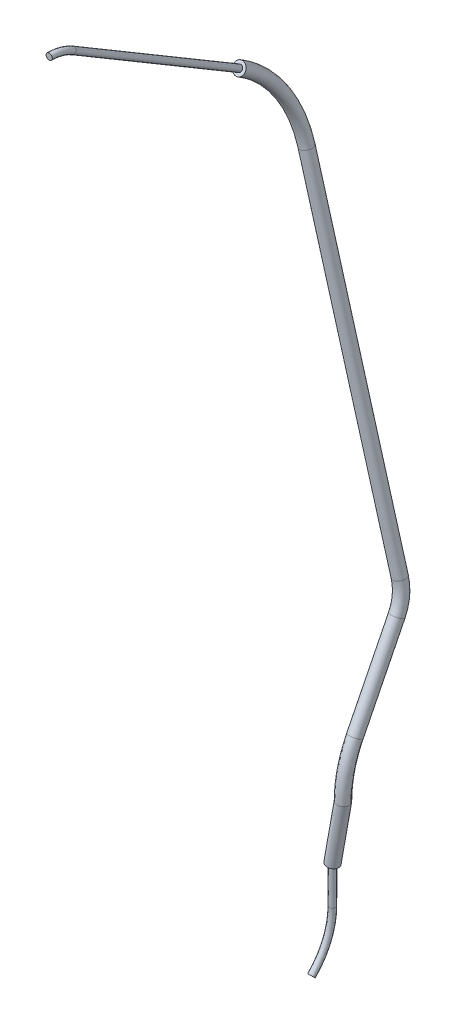
ISO-10303-21;
HEADER;
FILE_DESCRIPTION(('STEP AP214'),'2;1');
FILE_NAME('part.step','',(''),(''),'','','');
FILE_SCHEMA(('AUTOMOTIVE_DESIGN { 1 0 10303 214 1 1 1 1 }'));
ENDSEC;
DATA;
#1=APPLICATION_CONTEXT('core data for automotive mechanical design processes');
#2=APPLICATION_PROTOCOL_DEFINITION('international standard','automotive_design',2000,#1);
#3=PRODUCT_CONTEXT('',#1,'mechanical');
#4=PRODUCT('Part','Part','',(#3));
#5=PRODUCT_RELATED_PRODUCT_CATEGORY('part','',(#4));
#6=PRODUCT_DEFINITION_FORMATION('','',#4);
#7=PRODUCT_DEFINITION_CONTEXT('part definition',#1,'design');
#8=PRODUCT_DEFINITION('design','',#6,#7);
#9=PRODUCT_DEFINITION_SHAPE('','',#8);
#10=(LENGTH_UNIT() NAMED_UNIT(*) SI_UNIT(.MILLI.,.METRE.));
#11=(NAMED_UNIT(*) PLANE_ANGLE_UNIT() SI_UNIT($,.RADIAN.));
#12=(NAMED_UNIT(*) SI_UNIT($,.STERADIAN.) SOLID_ANGLE_UNIT());
#13=UNCERTAINTY_MEASURE_WITH_UNIT(LENGTH_MEASURE(1.E-05),#10,'distance_accuracy_value','');
#14=(GEOMETRIC_REPRESENTATION_CONTEXT(3) GLOBAL_UNCERTAINTY_ASSIGNED_CONTEXT((#13)) GLOBAL_UNIT_ASSIGNED_CONTEXT((#10,
#11,#12)) REPRESENTATION_CONTEXT('',''));
#15=CARTESIAN_POINT('',(0.,0.,0.));
#16=DIRECTION('',(0.,0.,1.));
#17=DIRECTION('',(1.,0.,0.));
#18=AXIS2_PLACEMENT_3D('',#15,#16,#17);
#19=CARTESIAN_POINT('',(0.,-17.0234803331168,-30.765300405085));
#20=DIRECTION('',(0.,0.510042589765679,0.860149147895363));
#21=DIRECTION('',(0.,-0.860149147895363,0.510042589765679));
#22=AXIS2_PLACEMENT_3D('',#19,#20,#21);
#23=PLANE('',#22);
#24=CARTESIAN_POINT('',(0.,-17.0234803331169,-30.765300405085));
#25=DIRECTION('',(0.,0.510042589765679,0.860149147895363));
#26=DIRECTION('',(0.,-0.860149147895363,0.510042589765679));
#27=AXIS2_PLACEMENT_3D('',#24,#25,#26);
#28=CIRCLE('',#27,0.5);
#29=CARTESIAN_POINT('',(0.,-17.4535549070645,-30.5102791102022));
#30=VERTEX_POINT('',#29);
#31=EDGE_CURVE('E85',#30,#30,#28,.F.);
#32=ORIENTED_EDGE('',*,*,#31,.T.);
#33=EDGE_LOOP('',(#32));
#34=FACE_BOUND('',#33,.T.);
#35=CARTESIAN_POINT('',(0.,-17.0234803331168,-30.765300405085));
#36=DIRECTION('',(0.,0.510042589765679,0.860149147895363));
#37=DIRECTION('',(0.,-0.860149147895363,0.510042589765679));
#38=AXIS2_PLACEMENT_3D('',#35,#36,#37);
#39=CIRCLE('',#38,1.);
#40=CARTESIAN_POINT('',(0.,-17.8836294810122,-30.2552578153194));
#41=VERTEX_POINT('',#40);
#42=EDGE_CURVE('E185',#41,#41,#39,.T.);
#43=ORIENTED_EDGE('',*,*,#42,.T.);
#44=EDGE_LOOP('',(#43));
#45=FACE_BOUND('',#44,.T.);
#46=ADVANCED_FACE('F33',(#34,#45),#23,.T.);
#47=CARTESIAN_POINT('',(11.3750000000001,-124.64905017384,-34.4978009791702));
#48=DIRECTION('',(0.173648177666929,0.98480358649297,-0.00286468559155684));
#49=DIRECTION('',(-0.145674277803661,0.0285630746051352,0.988920196757799));
#50=AXIS2_PLACEMENT_3D('',#47,#48,#49);
#51=PLANE('',#50);
#52=CARTESIAN_POINT('',(11.375,-124.64905017384,-34.4978009791702));
#53=DIRECTION('',(0.173648177666929,0.98480358649297,-0.00286468559155684));
#54=DIRECTION('',(-0.984807627375507,0.173648890186561,0.));
#55=AXIS2_PLACEMENT_3D('',#52,#53,#54);
#56=CIRCLE('',#55,0.5);
#57=CARTESIAN_POINT('',(11.3750000000002,-124.647595734848,-33.9978030945674));
#58=VERTEX_POINT('',#57);
#59=CARTESIAN_POINT('',(11.3750000000002,-124.650504612832,-34.9977988637729));
#60=VERTEX_POINT('',#59);
#61=EDGE_CURVE('E47',#58,#60,#56,.F.);
#62=ORIENTED_EDGE('',*,*,#61,.F.);
#63=CARTESIAN_POINT('',(11.375,-124.64905017384,-34.4978009791702));
#64=DIRECTION('',(0.173648177666929,0.98480358649297,-0.00286468559155684));
#65=DIRECTION('',(-0.984807753012208,0.173647442997171,-0.000505121361044732));
#66=AXIS2_PLACEMENT_3D('',#63,#64,#65);
#67=ELLIPSE('',#66,0.507713305942873,0.5);
#68=EDGE_CURVE('E11',#60,#58,#67,.F.);
#69=ORIENTED_EDGE('',*,*,#68,.F.);
#70=EDGE_LOOP('',(#62,#69));
#71=FACE_BOUND('',#70,.T.);
#72=CARTESIAN_POINT('',(11.3750000000001,-124.64905017384,-34.4978009791702));
#73=DIRECTION('',(0.173648177666929,0.98480358649297,-0.00286468559155684));
#74=DIRECTION('',(-0.145674277803661,0.0285630746051352,0.988920196757799));
#75=AXIS2_PLACEMENT_3D('',#72,#73,#74);
#76=CIRCLE('',#75,1.);
#77=CARTESIAN_POINT('',(11.2293257221964,-124.620487099235,-33.5088807824124));
#78=VERTEX_POINT('',#77);
#79=EDGE_CURVE('E80',#78,#78,#76,.T.);
#80=ORIENTED_EDGE('',*,*,#79,.F.);
#81=EDGE_LOOP('',(#80));
#82=FACE_BOUND('',#81,.T.);
#83=ADVANCED_FACE('F130',(#71,#82),#51,.F.);
#84=CARTESIAN_POINT('',(12.8976518624823,-115.476512798986,-33.535479600478));
#85=CARTESIAN_POINT('',(12.8976518624823,-115.37498214047,-33.5357749420249));
#86=CARTESIAN_POINT('',(12.8976518624823,-115.276171129653,-33.5360609237852));
#87=CARTESIAN_POINT('',(12.8976518624823,-114.807790953746,-33.537429898796));
#88=CARTESIAN_POINT('',(12.8976518624823,-114.424757984721,-33.549307471736));
#89=CARTESIAN_POINT('',(12.8976518624823,-113.679036212126,-33.5945023204089));
#90=CARTESIAN_POINT('',(12.8976518624823,-113.306848611569,-33.627842588081));
#91=CARTESIAN_POINT('',(12.8976518624823,-112.194101175336,-33.7599244855131));
#92=CARTESIAN_POINT('',(12.8976518624823,-111.457356959447,-33.8907651080352));
#93=CARTESIAN_POINT('',(12.8976518624823,-110.003833049586,-34.2362701157988));
#94=CARTESIAN_POINT('',(12.8976518624823,-109.28707465675,-34.450929506154));
#95=CARTESIAN_POINT('',(12.8976518624823,-108.23408221172,-34.8336151213657));
#96=CARTESIAN_POINT('',(12.8976518624823,-107.886771382208,-34.9712845780664));
#97=CARTESIAN_POINT('',(12.8976518624823,-107.200640934191,-35.26639427387));
#98=CARTESIAN_POINT('',(12.8976518624823,-106.853328671839,-35.4280819249529));
#99=CARTESIAN_POINT('',(12.8976518624823,-106.52777446062,-35.5909186843684));
#100=CARTESIAN_POINT('',(14.8756500611594,-115.475652227574,-33.2396377754311));
#101=CARTESIAN_POINT('',(14.8756500611594,-115.374121569058,-33.239933116978));
#102=CARTESIAN_POINT('',(14.8756500611594,-115.276124100586,-33.2402167101983));
#103=CARTESIAN_POINT('',(14.8756500611594,-114.804088807291,-33.2415964165422));
#104=CARTESIAN_POINT('',(14.8756500611594,-114.412532565775,-33.2536625008502));
#105=CARTESIAN_POINT('',(14.8756500611594,-113.655467865224,-33.299544793461));
#106=CARTESIAN_POINT('',(14.8756500611594,-113.277619041818,-33.3333921889497));
#107=CARTESIAN_POINT('',(14.8756500611594,-112.147945971306,-33.4674831405649));
#108=CARTESIAN_POINT('',(14.8756500611594,-111.399995382111,-33.6003139366467));
#109=CARTESIAN_POINT('',(14.8756500611594,-109.924362399421,-33.9510743071397));
#110=CARTESIAN_POINT('',(14.8756500611594,-109.196701631046,-34.1689988106879));
#111=CARTESIAN_POINT('',(14.8756500611594,-108.127692465197,-34.5575053305905));
#112=CARTESIAN_POINT('',(14.8756500611594,-107.775098805196,-34.6972688319955));
#113=CARTESIAN_POINT('',(14.8756500611594,-107.078531853211,-34.9968673440563));
#114=CARTESIAN_POINT('',(14.8756500611594,-106.723525381749,-35.1622204929431));
#115=CARTESIAN_POINT('',(14.8756500611594,-106.395430629614,-35.3263279883398));
#116=CARTESIAN_POINT('',(15.1714931378575,-115.481405982987,-35.2176276056042));
#117=CARTESIAN_POINT('',(15.1714931378575,-115.379875324471,-35.2179229471512));
#118=CARTESIAN_POINT('',(15.1714931378575,-115.276438535558,-35.2182225100807));
#119=CARTESIAN_POINT('',(15.1714931378575,-114.828841250722,-35.2195304670411));
#120=CARTESIAN_POINT('',(15.1714931378575,-114.494271360971,-35.2303361698339));
#121=CARTESIAN_POINT('',(15.1714931378575,-113.813045146516,-35.2716222322851));
#122=CARTESIAN_POINT('',(15.1714931378575,-113.473047094282,-35.3020789859551));
#123=CARTESIAN_POINT('',(15.1714931378575,-112.456538321864,-35.42273745979));
#124=CARTESIAN_POINT('',(15.1714931378575,-111.783513218335,-35.5422620133885));
#125=CARTESIAN_POINT('',(15.1714931378575,-110.45570085302,-35.8578851816507));
#126=CARTESIAN_POINT('',(15.1714931378575,-109.800933050115,-36.0539792334336));
#127=CARTESIAN_POINT('',(15.1714931378575,-108.839011213394,-36.4035673540367));
#128=CARTESIAN_POINT('',(15.1714931378575,-108.521738404256,-36.5293301335076));
#129=CARTESIAN_POINT('',(15.1714931378575,-107.894949613991,-36.7989165507335));
#130=CARTESIAN_POINT('',(15.1714931378575,-107.591386400654,-36.9397622880128));
#131=CARTESIAN_POINT('',(15.1714931378575,-107.280277631131,-37.0953736796313));
#132=CARTESIAN_POINT('',(13.1934949391805,-115.482266554399,-35.5134694306511));
#133=CARTESIAN_POINT('',(13.1934949391805,-115.380735895883,-35.5137647721981));
#134=CARTESIAN_POINT('',(13.1934949391805,-115.276485564625,-35.5140667236677));
#135=CARTESIAN_POINT('',(13.1934949391805,-114.832543397177,-35.5153639492942));
#136=CARTESIAN_POINT('',(13.1934949391805,-114.506496779917,-35.5259811407203));
#137=CARTESIAN_POINT('',(13.1934949391805,-113.836613493418,-35.5665797592323));
#138=CARTESIAN_POINT('',(13.1934949391805,-113.502276664032,-35.5965293850864));
#139=CARTESIAN_POINT('',(13.1934949391805,-112.502693525897,-35.7151788047383));
#140=CARTESIAN_POINT('',(13.1934949391805,-111.840874795666,-35.8327131847771));
#141=CARTESIAN_POINT('',(13.1934949391805,-110.53517150319,-36.1430809903099));
#142=CARTESIAN_POINT('',(13.1934949391805,-109.891306075819,-36.3359099288984));
#143=CARTESIAN_POINT('',(13.1934949391805,-108.945400959917,-36.6796771448126));
#144=CARTESIAN_POINT('',(13.1934949391805,-108.633410981268,-36.8033458795796));
#145=CARTESIAN_POINT('',(13.1934949391805,-108.01705869497,-37.068443480546));
#146=CARTESIAN_POINT('',(13.1934949391805,-107.721189690744,-37.2056237200226));
#147=CARTESIAN_POINT('',(13.1934949391805,-107.412621462137,-37.3599643756599));
#148=CARTESIAN_POINT('',(11.2154967405034,-115.483127125812,-35.809311255698));
#149=CARTESIAN_POINT('',(11.2154967405034,-115.381596467296,-35.809606597245));
#150=CARTESIAN_POINT('',(11.2154967405034,-115.276532593693,-35.8099109372547));
#151=CARTESIAN_POINT('',(11.2154967405034,-114.836245543631,-35.8111974315474));
#152=CARTESIAN_POINT('',(11.2154967405034,-114.518722198863,-35.8216261116068));
#153=CARTESIAN_POINT('',(11.2154967405034,-113.86018184032,-35.8615372861795));
#154=CARTESIAN_POINT('',(11.2154967405034,-113.531506233781,-35.8909797842176));
#155=CARTESIAN_POINT('',(11.2154967405034,-112.548848729929,-36.0076201496865));
#156=CARTESIAN_POINT('',(11.2154967405034,-111.898236372998,-36.1231643561657));
#157=CARTESIAN_POINT('',(11.2154967405034,-110.61464215336,-36.428276798969));
#158=CARTESIAN_POINT('',(11.2154967405034,-109.981679101523,-36.6178406243632));
#159=CARTESIAN_POINT('',(11.2154967405034,-109.051790706441,-36.9557869355884));
#160=CARTESIAN_POINT('',(11.2154967405034,-108.745083558281,-37.0773616256517));
#161=CARTESIAN_POINT('',(11.2154967405034,-108.139167775949,-37.3379704103585));
#162=CARTESIAN_POINT('',(11.2154967405034,-107.850992980833,-37.4714851520323));
#163=CARTESIAN_POINT('',(11.2154967405034,-107.544965293143,-37.6245550716885));
#164=CARTESIAN_POINT('',(10.9196536638052,-115.477373370399,-33.8313214255249));
#165=CARTESIAN_POINT('',(10.9196536638052,-115.375842711883,-33.8316167670718));
#166=CARTESIAN_POINT('',(10.9196536638052,-115.27621815872,-33.831905137372));
#167=CARTESIAN_POINT('',(10.9196536638052,-114.811493100201,-33.8332633810497));
#168=CARTESIAN_POINT('',(10.9196536638052,-114.436983403667,-33.8449524426218));
#169=CARTESIAN_POINT('',(10.9196536638052,-113.702604559028,-33.8894598473567));
#170=CARTESIAN_POINT('',(10.9196536638052,-113.33607818132,-33.9222929872122));
#171=CARTESIAN_POINT('',(10.9196536638052,-112.240256379367,-34.0523658304613));
#172=CARTESIAN_POINT('',(10.9196536638052,-111.514718536783,-34.1812162794238));
#173=CARTESIAN_POINT('',(10.9196536638052,-110.083303699751,-34.5214659244579));
#174=CARTESIAN_POINT('',(10.9196536638052,-109.377447682454,-34.7328602016201));
#175=CARTESIAN_POINT('',(10.9196536638052,-108.340471958244,-35.109724912141));
#176=CARTESIAN_POINT('',(10.9196536638052,-107.998443959219,-35.2453003241372));
#177=CARTESIAN_POINT('',(10.9196536638052,-107.322750015171,-35.5359212036837));
#178=CARTESIAN_POINT('',(10.9196536638052,-106.983131961928,-35.6939433569626));
#179=CARTESIAN_POINT('',(10.9196536638052,-106.660118291626,-35.855509380397));
#180=CARTESIAN_POINT('',(12.8976518624823,-115.476512798986,-33.535479600478));
#181=CARTESIAN_POINT('',(12.8976518624823,-115.37498214047,-33.5357749420249));
#182=CARTESIAN_POINT('',(12.8976518624823,-115.276171129653,-33.5360609237852));
#183=CARTESIAN_POINT('',(12.8976518624823,-114.807790953746,-33.537429898796));
#184=CARTESIAN_POINT('',(12.8976518624823,-114.424757984721,-33.549307471736));
#185=CARTESIAN_POINT('',(12.8976518624823,-113.679036212126,-33.5945023204089));
#186=CARTESIAN_POINT('',(12.8976518624823,-113.306848611569,-33.627842588081));
#187=CARTESIAN_POINT('',(12.8976518624823,-112.194101175336,-33.7599244855131));
#188=CARTESIAN_POINT('',(12.8976518624823,-111.457356959447,-33.8907651080352));
#189=CARTESIAN_POINT('',(12.8976518624823,-110.003833049586,-34.2362701157988));
#190=CARTESIAN_POINT('',(12.8976518624823,-109.28707465675,-34.450929506154));
#191=CARTESIAN_POINT('',(12.8976518624823,-108.23408221172,-34.8336151213657));
#192=CARTESIAN_POINT('',(12.8976518624823,-107.886771382208,-34.9712845780664));
#193=CARTESIAN_POINT('',(12.8976518624823,-107.200640934191,-35.26639427387));
#194=CARTESIAN_POINT('',(12.8976518624823,-106.853328671839,-35.4280819249529));
#195=CARTESIAN_POINT('',(12.8976518624823,-106.52777446062,-35.5909186843684));
#196=(BOUNDED_SURFACE() B_SPLINE_SURFACE(3,3,((#84,#85,#86,#87,#88,#89,#90,#91,#92,#93,#94,#95,
#96,#97,#98,#99),(#100,#101,#102,#103,#104,#105,#106,#107,#108,#109,#110,#111,#112,#113,#114,
#115),(#116,#117,#118,#119,#120,#121,#122,#123,#124,#125,#126,#127,#128,#129,#130,#131),(#132,
#133,#134,#135,#136,#137,#138,#139,#140,#141,#142,#143,#144,#145,#146,#147),(#148,#149,#150,
#151,#152,#153,#154,#155,#156,#157,#158,#159,#160,#161,#162,#163),(#164,#165,#166,#167,#168,
#169,#170,#171,#172,#173,#174,#175,#176,#177,#178,#179),(#180,#181,#182,#183,#184,#185,#186,
#187,#188,#189,#190,#191,#192,#193,#194,#195)),.UNSPECIFIED.,.T.,.F.,
.F.) B_SPLINE_SURFACE_WITH_KNOTS((4,3,4),(4,2,2,2,2,2,2,4),(0.,0.5,1.),(-0.00290507929286196,0.,
0.01014698357128,0.02029396714256,0.0405879342851201,0.0608819014276801,0.0710288849989601,
0.0811758685702401),
.UNSPECIFIED.) GEOMETRIC_REPRESENTATION_ITEM() RATIONAL_B_SPLINE_SURFACE(((1.,1.,1.,1.,1.,1.,1.,
1.,1.,1.,1.,1.,1.,1.,1.,1.),(0.333333333333333,0.333333333333333,0.333333333333333,
0.333333333333333,0.333333333333333,0.333333333333333,0.333333333333333,0.333333333333333,
0.333333333333333,0.333333333333333,0.333333333333333,0.333333333333333,0.333333333333333,
0.333333333333333,0.333333333333333,0.333333333333333),(0.333333333333333,0.333333333333333,
0.333333333333333,0.333333333333333,0.333333333333333,0.333333333333333,0.333333333333333,
0.333333333333333,0.333333333333333,0.333333333333333,0.333333333333333,0.333333333333333,
0.333333333333333,0.333333333333333,0.333333333333333,0.333333333333333),(1.,1.,1.,1.,1.,1.,1.,
1.,1.,1.,1.,1.,1.,1.,1.,1.),(0.333333333333333,0.333333333333333,0.333333333333333,
0.333333333333333,0.333333333333333,0.333333333333333,0.333333333333333,0.333333333333333,
0.333333333333333,0.333333333333333,0.333333333333333,0.333333333333333,0.333333333333333,
0.333333333333333,0.333333333333333,0.333333333333333),(0.333333333333333,0.333333333333333,
0.333333333333333,0.333333333333333,0.333333333333333,0.333333333333333,0.333333333333333,
0.333333333333333,0.333333333333333,0.333333333333333,0.333333333333333,0.333333333333333,
0.333333333333333,0.333333333333333,0.333333333333333,0.333333333333333),(1.,1.,1.,1.,1.,1.,1.,
1.,1.,1.,1.,1.,1.,1.,1.,1.))) REPRESENTATION_ITEM('') SURFACE());
#197=CARTESIAN_POINT('',(13.0456480512263,-115.177719741952,-35.525356268205));
#198=CARTESIAN_POINT('',(13.0506880710525,-115.178160676879,-35.5253548638416));
#199=CARTESIAN_POINT('',(13.0557292600387,-115.178601600282,-35.5253150567005));
#200=CARTESIAN_POINT('',(13.1170184255026,-115.183960827906,-35.5243651433296));
#201=CARTESIAN_POINT('',(13.1733206837038,-115.188869881261,-35.5187221224035));
#202=CARTESIAN_POINT('',(13.2564245092729,-115.196095058757,-35.5032308128934));
#203=CARTESIAN_POINT('',(13.2839433111579,-115.198484052794,-35.4968802756896));
#204=CARTESIAN_POINT('',(13.3383777073896,-115.20320253765,-35.4818706508086));
#205=CARTESIAN_POINT('',(13.3652928153871,-115.20553198069,-35.4732097695103));
#206=CARTESIAN_POINT('',(13.4447014694037,-115.212393629899,-35.4438792813993));
#207=CARTESIAN_POINT('',(13.4960014434298,-115.216811596923,-35.4198350125656));
#208=CARTESIAN_POINT('',(13.5938202232812,-115.225205073602,-35.363438917827));
#209=CARTESIAN_POINT('',(13.6403389000351,-115.229180571312,-35.3310868677356));
#210=CARTESIAN_POINT('',(13.7272091911063,-115.23657068124,-35.2590420301475));
#211=CARTESIAN_POINT('',(13.7675720993334,-115.239986321502,-35.2193629885686));
#212=CARTESIAN_POINT('',(13.8410642321791,-115.246166533288,-35.1337413918202));
#213=CARTESIAN_POINT('',(13.8741926772914,-115.248931034655,-35.0877981625563));
#214=CARTESIAN_POINT('',(13.9321411344282,-115.253719270187,-34.9911371185814));
#215=CARTESIAN_POINT('',(13.9569913758663,-115.25574570214,-34.9404375618482));
#216=CARTESIAN_POINT('',(13.9978276957464,-115.25901295384,-34.8355636706525));
#217=CARTESIAN_POINT('',(14.0138141256713,-115.260253804737,-34.7813894740673));
#218=CARTESIAN_POINT('',(14.0364194156899,-115.261910878692,-34.6712965098488));
#219=CARTESIAN_POINT('',(14.0430692051152,-115.262329826295,-34.6153841325043));
#220=CARTESIAN_POINT('',(14.0469073066588,-115.262339002835,-34.5032357568276));
#221=CARTESIAN_POINT('',(14.0440957234319,-115.261929240937,-34.4469997620819));
#222=CARTESIAN_POINT('',(14.0291050219369,-115.26029412185,-34.3358927268408));
#223=CARTESIAN_POINT('',(14.0169405311228,-115.259070038618,-34.2810196929521));
#224=CARTESIAN_POINT('',(13.9836139525308,-115.255842890581,-34.1741013992005));
#225=CARTESIAN_POINT('',(13.9624517431595,-115.253839815248,-34.1220561775629));
#226=CARTESIAN_POINT('',(13.9117172184365,-115.249110214896,-34.02221600106));
#227=CARTESIAN_POINT('',(13.8821370662205,-115.246383015898,-33.9744250614947));
#228=CARTESIAN_POINT('',(13.8154253904287,-115.240284369506,-33.8844932819677));
#229=CARTESIAN_POINT('',(13.7782944238842,-115.236912969638,-33.8423520256035));
#230=CARTESIAN_POINT('',(13.6972694304392,-115.229597527702,-33.7646266056847));
#231=CARTESIAN_POINT('',(13.653330776989,-115.225649717707,-33.7290893833474));
#232=CARTESIAN_POINT('',(13.5601058711593,-115.217309223595,-33.6659170016134));
#233=CARTESIAN_POINT('',(13.5108196071131,-115.212916538508,-33.6382818594566));
#234=CARTESIAN_POINT('',(13.433968431072,-115.206090812053,-33.6033399641118));
#235=CARTESIAN_POINT('',(13.4078325823464,-115.203773310941,-33.5927693850352));
#236=CARTESIAN_POINT('',(13.3547936037068,-115.199077762171,-33.5738785238962));
#237=CARTESIAN_POINT('',(13.3278911455966,-115.19669976771,-33.5655563347068));
#238=CARTESIAN_POINT('',(13.2463664398601,-115.189504240184,-33.5440755439396));
#239=CARTESIAN_POINT('',(13.1907883014494,-115.184612858106,-33.5343398874265));
#240=CARTESIAN_POINT('',(13.1106594589738,-115.177581825129,-33.5271707435188));
#241=CARTESIAN_POINT('',(13.0863836369353,-115.175454439984,-33.525891845444));
#242=CARTESIAN_POINT('',(13.0565596758133,-115.172843094902,-33.5254070855864));
#243=CARTESIAN_POINT('',(13.0510249464713,-115.172358576461,-33.5253630259317));
#244=CARTESIAN_POINT('',(13.0454900658595,-115.171874129037,-33.5253648173606));
#245=B_SPLINE_CURVE_WITH_KNOTS('',3,(#197,#198,#199,#200,#201,#202,#203,#204,#205,#206,#207,
#208,#209,#210,#211,#212,#213,#214,#215,#216,#217,#218,#219,#220,#221,#222,#223,#224,#225,#226,
#227,#228,#229,#230,#231,#232,#233,#234,#235,#236,#237,#238,#239,#240,#241,#242,#243,#244),
.UNSPECIFIED.,.F.,.F.,(4,2,2,2,2,2,2,2,2,2,2,2,2,2,2,2,2,2,2,2,2,2,2,4),(0.,0.0151810411372486,
0.184550154762547,0.269503890748024,0.354523772954298,0.524130805151303,0.693742414694329,
0.86303899627923,1.03235381041112,1.2010433830582,1.36972626606195,1.53784902702759,
1.70596992834797,1.87382843094029,2.04168920201334,2.20970676079039,2.37771192923624,
2.54686905768473,2.71602655517962,2.80080101970897,2.8855033495406,3.05445559388846,
3.12761362032992,3.14428125035015),.UNSPECIFIED.);
#246=CARTESIAN_POINT('',(13.0456480512263,-115.177719741952,-35.525356268205));
#247=VERTEX_POINT('',#246);
#248=CARTESIAN_POINT('',(13.0454900658595,-115.171874129037,-33.5253648173606));
#249=VERTEX_POINT('',#248);
#250=EDGE_CURVE('E74',#247,#249,#245,.T.);
#251=CARTESIAN_POINT('',(13.0456480512263,-115.177719741952,-35.525356268205));
#252=CARTESIAN_POINT('',(13.0406075363986,-115.177284465176,-35.5253581762457));
#253=CARTESIAN_POINT('',(13.035565845213,-115.176848995251,-35.5253216902201));
#254=CARTESIAN_POINT('',(12.9742634547718,-115.171552915975,-35.5244121446348));
#255=CARTESIAN_POINT('',(12.9179475889508,-115.166675757407,-35.5188059788634));
#256=CARTESIAN_POINT('',(12.8348228755158,-115.159450601128,-35.5033685413933));
#257=CARTESIAN_POINT('',(12.8072970264856,-115.157053593827,-35.4970357557382));
#258=CARTESIAN_POINT('',(12.752848428098,-115.15230298225,-35.4820609784066));
#259=CARTESIAN_POINT('',(12.725926165389,-115.149949413248,-35.4734171912386));
#260=CARTESIAN_POINT('',(12.646495812297,-115.142990386802,-35.4441364695739));
#261=CARTESIAN_POINT('',(12.5951813711245,-115.13847420438,-35.4201235159846));
#262=CARTESIAN_POINT('',(12.4973353093476,-115.129816774016,-35.3637847602441));
#263=CARTESIAN_POINT('',(12.4508038109264,-115.125675535651,-35.3314587458046));
#264=CARTESIAN_POINT('',(12.3639163813357,-115.11788974922,-35.2594638386449));
#265=CARTESIAN_POINT('',(12.323548410589,-115.114244234392,-35.2198096045421));
#266=CARTESIAN_POINT('',(12.250048913797,-115.107545531174,-35.1342320730524));
#267=CARTESIAN_POINT('',(12.2169181595973,-115.104492405966,-35.0883081078497));
#268=CARTESIAN_POINT('',(12.1589734451786,-115.099079643021,-34.9916881857385));
#269=CARTESIAN_POINT('',(12.1341278270904,-115.096717369867,-34.9410113639274));
#270=CARTESIAN_POINT('',(12.0933006657735,-115.092742472137,-34.8361784843608));
#271=CARTESIAN_POINT('',(12.0773187685148,-115.09112981762,-34.7820225656619));
#272=CARTESIAN_POINT('',(12.0547214893154,-115.088709676682,-34.6719623149352));
#273=CARTESIAN_POINT('',(12.0480750075303,-115.087899519506,-34.6160644253758));
#274=CARTESIAN_POINT('',(12.0442403682262,-115.087103756397,-34.5039395902785));
#275=CARTESIAN_POINT('',(12.04705211418,-115.087118142049,-34.4477126481047));
#276=CARTESIAN_POINT('',(12.0620397228348,-115.087975826686,-34.3366086990855));
#277=CARTESIAN_POINT('',(12.0742024071583,-115.088817959583,-34.2817299045088));
#278=CARTESIAN_POINT('',(12.1075226345496,-115.091309998354,-34.1747935229144));
#279=CARTESIAN_POINT('',(12.1286803104293,-115.092959916155,-34.1227359775656));
#280=CARTESIAN_POINT('',(12.1794073067195,-115.097026170949,-34.0228550698146));
#281=CARTESIAN_POINT('',(12.2089859833434,-115.099443360771,-33.9750364950833));
#282=CARTESIAN_POINT('',(12.275694653405,-115.10497668525,-33.8850446898821));
#283=CARTESIAN_POINT('',(12.3128240891435,-115.108092768289,-33.8428710428588));
#284=CARTESIAN_POINT('',(12.3938419848601,-115.114958384712,-33.7650812774159));
#285=CARTESIAN_POINT('',(12.4377743662533,-115.118712050937,-33.7295113321337));
#286=CARTESIAN_POINT('',(12.5309865897232,-115.126732145851,-33.6662699787553));
#287=CARTESIAN_POINT('',(12.5802664359401,-115.130998574938,-33.6385985767743));
#288=CARTESIAN_POINT('',(12.65710869899,-115.137686280659,-33.603601049466));
#289=CARTESIAN_POINT('',(12.683241804936,-115.139966331813,-33.5930116673303));
#290=CARTESIAN_POINT('',(12.7362755409991,-115.144603865691,-33.5740831250766));
#291=CARTESIAN_POINT('',(12.7631754994813,-115.146961280914,-33.5657420589355));
#292=CARTESIAN_POINT('',(12.844693066445,-115.154119617395,-33.5442049849157));
#293=CARTESIAN_POINT('',(12.9002670216232,-115.159018703562,-33.5344321170469));
#294=CARTESIAN_POINT('',(12.9803688236629,-115.166102402278,-33.5272133717393));
#295=CARTESIAN_POINT('',(13.004621362917,-115.168250049635,-33.5259194934648));
#296=CARTESIAN_POINT('',(13.034421626634,-115.170892314081,-33.5254146431298));
#297=CARTESIAN_POINT('',(13.0399557644884,-115.171383144495,-33.5253668001387));
#298=CARTESIAN_POINT('',(13.0454900658595,-115.171874129037,-33.5253648173606));
#299=B_SPLINE_CURVE_WITH_KNOTS('',3,(#251,#252,#253,#254,#255,#256,#257,#258,#259,#260,#261,
#262,#263,#264,#265,#266,#267,#268,#269,#270,#271,#272,#273,#274,#275,#276,#277,#278,#279,#280,
#281,#282,#283,#284,#285,#286,#287,#288,#289,#290,#291,#292,#293,#294,#295,#296,#297,#298),
.UNSPECIFIED.,.F.,.F.,(4,2,2,2,2,2,2,2,2,2,2,2,2,2,2,2,2,2,2,2,2,2,2,4),(0.,0.0151810505493031,
0.184571447944398,0.269535818811115,0.354566394032281,0.524195812760492,0.693829563695908,
0.863127599030947,1.03244368111398,1.20110518062008,1.36975994305314,1.53785150838931,
1.7059413582509,1.87379475054983,2.04165062130923,2.20969372227483,2.3777244160761,
2.54688904079616,2.71605379648856,2.80083258962083,2.8855392833638,3.05449986770103,
3.12759624314076,3.14426386166263),.UNSPECIFIED.);
#300=EDGE_CURVE('E78',#247,#249,#299,.T.);
#301=CARTESIAN_POINT('',(13.0455734008314,-106.970197961378,-36.4754415300141));
#302=DIRECTION('',(0.,0.894361629082733,-0.447344695312776));
#303=DIRECTION('',(-0.147921538349074,0.44242350075821,0.884522845645772));
#304=AXIS2_PLACEMENT_3D('',#301,#302,#303);
#305=CIRCLE('',#304,1.);
#306=CARTESIAN_POINT('',(12.8976518624823,-106.52777446062,-35.5909186843684));
#307=VERTEX_POINT('',#306);
#308=EDGE_CURVE('E97',#307,#307,#305,.T.);
#309=ORIENTED_EDGE('',*,*,#250,.F.);
#310=ORIENTED_EDGE('',*,*,#300,.T.);
#311=EDGE_LOOP('',(#309,#310));
#312=FACE_BOUND('',#311,.T.);
#313=ORIENTED_EDGE('',*,*,#308,.F.);
#314=EDGE_LOOP('',(#313));
#315=FACE_BOUND('',#314,.T.);
#316=ADVANCED_FACE('F76',(#312,#315),#196,.T.);
#317=CARTESIAN_POINT('',(13.0455734008314,-106.970197961378,-36.4754415300141));
#318=DIRECTION('',(0.,0.894361629082732,-0.447344695312777));
#319=DIRECTION('',(0.,0.447344695312777,0.894361629082732));
#320=AXIS2_PLACEMENT_3D('',#317,#318,#319);
#321=CYLINDRICAL_SURFACE('',#320,1.);
#322=CARTESIAN_POINT('',(13.0455734008314,-93.4356759823917,-43.245182554239));
#323=DIRECTION('',(0.,0.894361629082732,-0.447344695312777));
#324=DIRECTION('',(-0.147921538349074,0.44242350075821,0.884522845645772));
#325=AXIS2_PLACEMENT_3D('',#322,#323,#324);
#326=CIRCLE('',#325,1.);
#327=CARTESIAN_POINT('',(13.3895284690797,-93.8557264367801,-44.0849756994803));
#328=VERTEX_POINT('',#327);
#329=EDGE_CURVE('E198',#328,#328,#326,.T.);
#330=ORIENTED_EDGE('',*,*,#329,.F.);
#331=EDGE_LOOP('',(#330));
#332=FACE_BOUND('',#331,.T.);
#333=ORIENTED_EDGE('',*,*,#308,.T.);
#334=EDGE_LOOP('',(#333));
#335=FACE_BOUND('',#334,.T.);
#336=ADVANCED_FACE('F104',(#332,#335),#321,.T.);
#337=CARTESIAN_POINT('',(10.0825614332426,-89.8171378701828,-36.0107575686685));
#338=DIRECTION('',(0.938986108004958,0.153866475206827,0.307620215169823));
#339=DIRECTION('',(0.311327613512521,0.,-0.950302644984532));
#340=AXIS2_PLACEMENT_3D('',#337,#338,#339);
#341=TOROIDAL_SURFACE('',#340,8.61453207443263,1.);
#342=CARTESIAN_POINT('',(12.5817271709701,-88.7303440057256,-44.1828572115373));
#343=DIRECTION('',(-0.184772883281832,0.980004702162173,0.0738225259913959));
#344=DIRECTION('',(-0.095178857744553,-0.092606872686413,0.991143255119907));
#345=AXIS2_PLACEMENT_3D('',#342,#343,#344);
#346=CIRCLE('',#345,1.);
#347=CARTESIAN_POINT('',(12.8718376164515,-88.6041858052491,-45.1314983649115));
#348=VERTEX_POINT('',#347);
#349=EDGE_CURVE('E191',#348,#348,#346,.T.);
#350=CARTESIAN_POINT('',(10.0825614332426,-89.8171378701828,-36.0107575686685));
#351=DIRECTION('',(0.938986108004958,0.153866475206827,0.307620215169823));
#352=DIRECTION('',(0.311327613512521,0.,-0.950302644984532));
#353=AXIS2_PLACEMENT_3D('',#350,#351,#352);
#354=CIRCLE('',#353,9.61453207443263);
#355=EDGE_CURVE('',#328,#348,#354,.T.);
#356=ORIENTED_EDGE('',*,*,#329,.T.);
#357=ORIENTED_EDGE('',*,*,#349,.F.);
#358=ORIENTED_EDGE('',*,*,#355,.T.);
#359=ORIENTED_EDGE('',*,*,#355,.F.);
#360=EDGE_LOOP('',(#356,#358,#357,#359));
#361=FACE_BOUND('',#360,.T.);
#362=ADVANCED_FACE('F113',(#361),#341,.T.);
#363=CARTESIAN_POINT('',(12.5817271709701,-88.7303440057256,-44.1828572115373));
#364=DIRECTION('',(-0.184772883281833,0.980004702162172,0.073822525991397));
#365=DIRECTION('',(-0.982686064581317,-0.185278435004408,0.));
#366=AXIS2_PLACEMENT_3D('',#363,#364,#365);
#367=CYLINDRICAL_SURFACE('',#366,1.);
#368=CARTESIAN_POINT('',(1.80246156195574,-31.5589084841167,-39.8762046256388));
#369=DIRECTION('',(-0.184772883281832,0.980004702162172,0.0738225259913975));
#370=DIRECTION('',(-0.0951788577445526,-0.0926068726864147,0.991143255119906));
#371=AXIS2_PLACEMENT_3D('',#368,#369,#370);
#372=CIRCLE('',#371,1.);
#373=CARTESIAN_POINT('',(1.70728270421119,-31.6515153568031,-38.8850613705189));
#374=VERTEX_POINT('',#373);
#375=EDGE_CURVE('E186',#374,#374,#372,.T.);
#376=ORIENTED_EDGE('',*,*,#375,.F.);
#377=EDGE_LOOP('',(#376));
#378=FACE_BOUND('',#377,.T.);
#379=ORIENTED_EDGE('',*,*,#349,.T.);
#380=EDGE_LOOP('',(#379));
#381=FACE_BOUND('',#380,.T.);
#382=ADVANCED_FACE('F117',(#378,#381),#367,.T.);
#383=CARTESIAN_POINT('',(4.12786140350094,-32.4979946508969,-21.5893785579047));
#384=DIRECTION('',(0.974672852995715,0.192359870865765,-0.114063621342215));
#385=DIRECTION('',(-0.193623565288446,0.981075896638476,0.));
#386=AXIS2_PLACEMENT_3D('',#383,#384,#385);
#387=TOROIDAL_SURFACE('',#386,18.4579894593982,1.);
#388=ORIENTED_EDGE('',*,*,#42,.F.);
#389=EDGE_LOOP('',(#388));
#390=FACE_BOUND('',#389,.T.);
#391=ORIENTED_EDGE('',*,*,#375,.T.);
#392=EDGE_LOOP('',(#391));
#393=FACE_BOUND('',#392,.T.);
#394=ADVANCED_FACE('F121',(#390,#393),#387,.T.);
#395=CARTESIAN_POINT('',(11.3750000000001,-124.64905017384,-34.4978009791702));
#396=DIRECTION('',(0.173648177666928,0.98480358649297,-0.00286468559155732));
#397=DIRECTION('',(-0.984807627375507,0.17364889018656,0.));
#398=AXIS2_PLACEMENT_3D('',#395,#396,#397);
#399=CYLINDRICAL_SURFACE('',#398,1.);
#400=ORIENTED_EDGE('',*,*,#300,.F.);
#401=ORIENTED_EDGE('',*,*,#250,.T.);
#402=EDGE_LOOP('',(#400,#401));
#403=FACE_BOUND('',#402,.T.);
#404=ORIENTED_EDGE('',*,*,#79,.T.);
#405=EDGE_LOOP('',(#404));
#406=FACE_BOUND('',#405,.T.);
#407=ADVANCED_FACE('F82',(#403,#406),#399,.T.);
#408=CARTESIAN_POINT('',(11.375,-138.770920476734,-31.0884357408697));
#409=DIRECTION('',(0.,0.705046902214677,-0.709160676911437));
#410=DIRECTION('',(0.98899909933854,0.104900138265411,0.104291622383845));
#411=AXIS2_PLACEMENT_3D('',#408,#409,#410);
#412=PLANE('',#411);
#413=CARTESIAN_POINT('',(11.375,-138.770920476734,-31.0884357408697));
#414=DIRECTION('',(0.,0.705046902214677,-0.709160676911437));
#415=DIRECTION('',(0.98899909933854,0.104900138265411,0.104291622383845));
#416=AXIS2_PLACEMENT_3D('',#413,#414,#415);
#417=CIRCLE('',#416,0.5);
#418=CARTESIAN_POINT('',(11.8694995496693,-138.718470407601,-31.0362899296778));
#419=VERTEX_POINT('',#418);
#420=EDGE_CURVE('E41',#419,#419,#417,.T.);
#421=ORIENTED_EDGE('',*,*,#420,.F.);
#422=EDGE_LOOP('',(#421));
#423=FACE_BOUND('',#422,.T.);
#424=ADVANCED_FACE('F141',(#423),#412,.F.);
#425=CARTESIAN_POINT('',(11.375,-130.615572692253,-22.9803963654009));
#426=DIRECTION('',(1.,0.,0.));
#427=DIRECTION('',(0.,0.,-1.));
#428=AXIS2_PLACEMENT_3D('',#425,#426,#427);
#429=TOROIDAL_SURFACE('',#428,11.5,0.5);
#430=CARTESIAN_POINT('',(11.375,-130.649024789073,-34.480347711264));
#431=DIRECTION('',(0.,0.999995769205486,-0.00290887798435158));
#432=DIRECTION('',(0.98899909933854,0.000430285706314986,0.147920912523442));
#433=AXIS2_PLACEMENT_3D('',#430,#431,#432);
#434=CIRCLE('',#433,0.5);
#435=CARTESIAN_POINT('',(11.8694995496693,-130.64880964622,-34.4063872550023));
#436=VERTEX_POINT('',#435);
#437=EDGE_CURVE('E168',#436,#436,#434,.T.);
#438=ORIENTED_EDGE('',*,*,#437,.F.);
#439=EDGE_LOOP('',(#438));
#440=FACE_BOUND('',#439,.T.);
#441=ORIENTED_EDGE('',*,*,#420,.T.);
#442=EDGE_LOOP('',(#441));
#443=FACE_BOUND('',#442,.T.);
#444=ADVANCED_FACE('F142',(#440,#443),#429,.T.);
#445=CARTESIAN_POINT('',(11.375,-130.649024789073,-34.480347711264));
#446=DIRECTION('',(0.,0.999995769205486,-0.00290887798435359));
#447=DIRECTION('',(0.,0.00290887798435359,0.999995769205486));
#448=AXIS2_PLACEMENT_3D('',#445,#446,#447);
#449=CYLINDRICAL_SURFACE('',#448,0.5);
#450=ORIENTED_EDGE('',*,*,#437,.T.);
#451=EDGE_LOOP('',(#450));
#452=FACE_BOUND('',#451,.T.);
#453=CARTESIAN_POINT('',(11.375,-124.64905017384,-34.4978009791702));
#454=DIRECTION('',(0.0871557427476569,0.996190483396682,-0.00289780882540854));
#455=DIRECTION('',(-0.996194698091746,0.0871553740096186,-0.000253525421292194));
#456=AXIS2_PLACEMENT_3D('',#453,#454,#455);
#457=ELLIPSE('',#456,0.501909918771674,0.5);
#458=CARTESIAN_POINT('',(10.875,-124.60530602715,-34.4979282260938));
#459=VERTEX_POINT('',#458);
#460=EDGE_CURVE('E171',#459,#60,#457,.F.);
#461=ORIENTED_EDGE('',*,*,#460,.T.);
#462=ORIENTED_EDGE('',*,*,#68,.T.);
#463=EDGE_CURVE('E177',#58,#459,#457,.F.);
#464=ORIENTED_EDGE('',*,*,#463,.T.);
#465=EDGE_LOOP('',(#461,#462,#464));
#466=FACE_BOUND('',#465,.T.);
#467=ADVANCED_FACE('F145',(#452,#466),#449,.T.);
#468=CARTESIAN_POINT('',(11.3402703644667,-124.846010891138,-34.4972280420518));
#469=DIRECTION('',(0.173648177666928,0.98480358649297,-0.00286468559155732));
#470=DIRECTION('',(-0.984807627375507,0.17364889018656,0.));
#471=AXIS2_PLACEMENT_3D('',#468,#469,#470);
#472=CYLINDRICAL_SURFACE('',#471,0.5);
#473=ORIENTED_EDGE('',*,*,#463,.F.);
#474=ORIENTED_EDGE('',*,*,#61,.T.);
#475=ORIENTED_EDGE('',*,*,#460,.F.);
#476=EDGE_LOOP('',(#473,#474,#475));
#477=FACE_BOUND('',#476,.T.);
#478=ADVANCED_FACE('F149',(#477),#472,.T.);
#479=CARTESIAN_POINT('',(0.,0.,0.));
#480=DIRECTION('',(0.,0.,1.));
#481=DIRECTION('',(1.,0.,0.));
#482=AXIS2_PLACEMENT_3D('',#479,#480,#481);
#483=PLANE('',#482);
#484=CARTESIAN_POINT('',(0.,0.,0.));
#485=DIRECTION('',(0.,0.,1.));
#486=DIRECTION('',(1.,0.,0.));
#487=AXIS2_PLACEMENT_3D('',#484,#485,#486);
#488=CIRCLE('',#487,0.5);
#489=CARTESIAN_POINT('',(0.5,0.,0.));
#490=VERTEX_POINT('',#489);
#491=EDGE_CURVE('E52',#490,#490,#488,.T.);
#492=ORIENTED_EDGE('',*,*,#491,.T.);
#493=EDGE_LOOP('',(#492));
#494=FACE_BOUND('',#493,.T.);
#495=ADVANCED_FACE('F35',(#494),#483,.T.);
#496=CARTESIAN_POINT('',(0.,-17.0234803331169,-30.765300405085));
#497=DIRECTION('',(0.,0.510042589765679,0.860149147895363));
#498=DIRECTION('',(0.,-0.860149147895363,0.510042589765679));
#499=AXIS2_PLACEMENT_3D('',#496,#497,#498);
#500=CYLINDRICAL_SURFACE('',#499,0.5);
#501=CARTESIAN_POINT('',(0.,-1.04888139078476,-3.8253194232425));
#502=DIRECTION('',(0.,0.510042589765679,0.860149147895363));
#503=DIRECTION('',(1.,0.,0.));
#504=AXIS2_PLACEMENT_3D('',#501,#502,#503);
#505=CIRCLE('',#504,0.5);
#506=CARTESIAN_POINT('',(0.5,-1.04888139078476,-3.8253194232425));
#507=VERTEX_POINT('',#506);
#508=EDGE_CURVE('E178',#507,#507,#505,.T.);
#509=ORIENTED_EDGE('',*,*,#508,.F.);
#510=EDGE_LOOP('',(#509));
#511=FACE_BOUND('',#510,.T.);
#512=ORIENTED_EDGE('',*,*,#31,.F.);
#513=EDGE_LOOP('',(#512));
#514=FACE_BOUND('',#513,.T.);
#515=ADVANCED_FACE('F155',(#511,#514),#500,.T.);
#516=CARTESIAN_POINT('',(0.,-7.49999999999998,0.));
#517=DIRECTION('',(1.,0.,0.));
#518=DIRECTION('',(0.,0.,-1.));
#519=AXIS2_PLACEMENT_3D('',#516,#517,#518);
#520=TOROIDAL_SURFACE('',#519,7.49999999999998,0.5);
#521=ORIENTED_EDGE('',*,*,#491,.F.);
#522=EDGE_LOOP('',(#521));
#523=FACE_BOUND('',#522,.T.);
#524=ORIENTED_EDGE('',*,*,#508,.T.);
#525=EDGE_LOOP('',(#524));
#526=FACE_BOUND('',#525,.T.);
#527=ADVANCED_FACE('F154',(#523,#526),#520,.T.);
#528=CLOSED_SHELL('',(#46,#83,#316,#336,#362,#382,#394,#407,#424,#444,#467,#478,#495,#515,#527));
#529=MANIFOLD_SOLID_BREP('B2',#528);
#530=ADVANCED_BREP_SHAPE_REPRESENTATION('',(#18,#529),#14);
#531=SHAPE_DEFINITION_REPRESENTATION(#9,#530);
ENDSEC;
END-ISO-10303-21;
